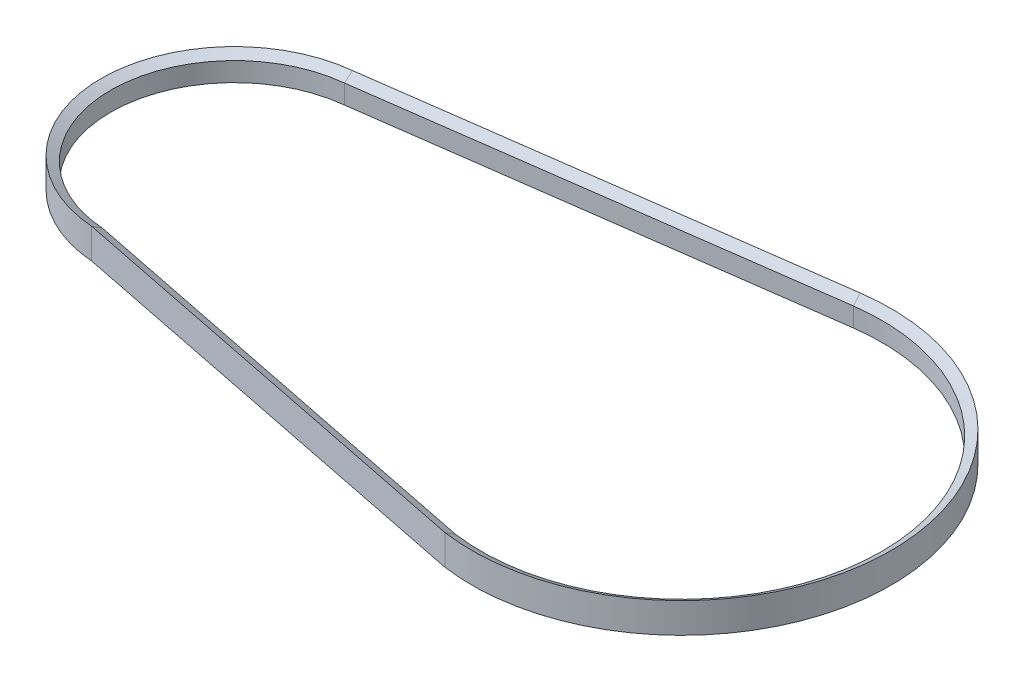
ISO-10303-21;
HEADER;
FILE_DESCRIPTION(('STEP AP214'),'2;1');
FILE_NAME('part.step','',(''),(''),'','','');
FILE_SCHEMA(('AUTOMOTIVE_DESIGN { 1 0 10303 214 1 1 1 1 }'));
ENDSEC;
DATA;
#1=APPLICATION_CONTEXT('core data for automotive mechanical design processes');
#2=APPLICATION_PROTOCOL_DEFINITION('international standard','automotive_design',2000,#1);
#3=PRODUCT_CONTEXT('',#1,'mechanical');
#4=PRODUCT('Part','Part','',(#3));
#5=PRODUCT_RELATED_PRODUCT_CATEGORY('part','',(#4));
#6=PRODUCT_DEFINITION_FORMATION('','',#4);
#7=PRODUCT_DEFINITION_CONTEXT('part definition',#1,'design');
#8=PRODUCT_DEFINITION('design','',#6,#7);
#9=PRODUCT_DEFINITION_SHAPE('','',#8);
#10=(LENGTH_UNIT() NAMED_UNIT(*) SI_UNIT(.MILLI.,.METRE.));
#11=(NAMED_UNIT(*) PLANE_ANGLE_UNIT() SI_UNIT($,.RADIAN.));
#12=(NAMED_UNIT(*) SI_UNIT($,.STERADIAN.) SOLID_ANGLE_UNIT());
#13=UNCERTAINTY_MEASURE_WITH_UNIT(LENGTH_MEASURE(1.E-05),#10,'distance_accuracy_value','');
#14=(GEOMETRIC_REPRESENTATION_CONTEXT(3) GLOBAL_UNCERTAINTY_ASSIGNED_CONTEXT((#13)) GLOBAL_UNIT_ASSIGNED_CONTEXT((#10,
#11,#12)) REPRESENTATION_CONTEXT('',''));
#15=CARTESIAN_POINT('',(0.,0.,0.));
#16=DIRECTION('',(0.,0.,1.));
#17=DIRECTION('',(1.,0.,0.));
#18=AXIS2_PLACEMENT_3D('',#15,#16,#17);
#19=CARTESIAN_POINT('',(-175.632341165328,6.035,-67.3771283987051));
#20=CARTESIAN_POINT('',(-185.237254141952,6.035,-66.4378723842523));
#21=CARTESIAN_POINT('',(-194.658380370483,6.035,-63.703087416971));
#22=CARTESIAN_POINT('',(-211.884484564325,6.035,-55.0078043698601));
#23=CARTESIAN_POINT('',(-219.681545041226,6.035,-49.0502554772838));
#24=CARTESIAN_POINT('',(-232.597850928129,6.035,-34.7144382072296));
#25=CARTESIAN_POINT('',(-237.713089284471,6.035,-26.3406172727995));
#26=CARTESIAN_POINT('',(-244.571622033232,6.035,-8.30434428981852));
#27=CARTESIAN_POINT('',(-246.312788677549,6.035,1.3525123001358));
#28=CARTESIAN_POINT('',(-246.18537714653,6.035,20.6483766465883));
#29=CARTESIAN_POINT('',(-244.316838498208,6.035,30.2813981771387));
#30=CARTESIAN_POINT('',(-237.220725399809,6.035,48.2255279541108));
#31=CARTESIAN_POINT('',(-231.995352402364,6.035,56.5310693291795));
#32=CARTESIAN_POINT('',(-218.890860831098,6.035,70.6950700071189));
#33=CARTESIAN_POINT('',(-211.015807692234,6.035,76.549135171205));
#34=CARTESIAN_POINT('',(-198.011236780126,6.035,82.8994190390512));
#35=CARTESIAN_POINT('',(-193.480610063308,6.035,84.6138788124924));
#36=CARTESIAN_POINT('',(-186.505233760073,6.035,86.5388882090312));
#37=CARTESIAN_POINT('',(-184.150385545113,6.035,87.0729563367836));
#38=CARTESIAN_POINT('',(-180.588649150114,6.035,87.7092187694637));
#39=CARTESIAN_POINT('',(-179.396494345239,6.035,87.8938484068089));
#40=CARTESIAN_POINT('',(-177.602772085792,6.035,88.129312317237));
#41=CARTESIAN_POINT('',(-177.0039493934,6.035,88.2008877864313));
#42=CARTESIAN_POINT('',(-176.104573473844,6.035,88.2978534914191));
#43=CARTESIAN_POINT('',(-175.804591160262,6.035,88.3284425301635));
#44=CARTESIAN_POINT('',(-175.204284000891,6.035,88.3861507144398));
#45=CARTESIAN_POINT('',(-174.915497802583,6.035,88.4140258141559));
#46=CARTESIAN_POINT('',(-174.147647121336,6.035,88.474629690754));
#47=CARTESIAN_POINT('',(-173.645566079561,6.035,88.5093176272365));
#48=CARTESIAN_POINT('',(-173.185405065056,6.035,88.543263703195));
#49=CARTESIAN_POINT('',(-177.100774969533,9.49910161513779,-73.1946624263381));
#50=CARTESIAN_POINT('',(-187.42333734258,9.49910161513779,-72.0742608219077));
#51=CARTESIAN_POINT('',(-197.527627740796,9.49910161513779,-69.0242677730329));
#52=CARTESIAN_POINT('',(-215.960583842075,9.49910161513779,-59.4724382332807));
#53=CARTESIAN_POINT('',(-224.280765375311,9.49910161513779,-52.9738651898177));
#54=CARTESIAN_POINT('',(-238.012536541069,9.49910161513779,-37.4030662160828));
#55=CARTESIAN_POINT('',(-243.419866136595,9.49910161513779,-28.3356708608856));
#56=CARTESIAN_POINT('',(-250.592119914945,9.49910161513779,-8.85311210213119));
#57=CARTESIAN_POINT('',(-252.354819023709,9.49910161513779,1.55600715602898));
#58=CARTESIAN_POINT('',(-251.996928136017,9.49910161513779,22.313734251216));
#59=CARTESIAN_POINT('',(-249.876449170169,9.49910161513779,32.6559023429134));
#60=CARTESIAN_POINT('',(-242.036847299154,9.49910161513779,51.8796366975172));
#61=CARTESIAN_POINT('',(-236.32015650249,9.49910161513779,60.7552391119491));
#62=CARTESIAN_POINT('',(-222.059783717249,9.49910161513779,75.843416207539));
#63=CARTESIAN_POINT('',(-213.520525756567,9.49910161513779,82.0513100388617));
#64=CARTESIAN_POINT('',(-199.457069405949,9.49910161513779,88.7343529059627));
#65=CARTESIAN_POINT('',(-194.563238321873,9.49910161513779,90.5269830762957));
#66=CARTESIAN_POINT('',(-187.036848190213,9.49910161513779,92.5181530127195));
#67=CARTESIAN_POINT('',(-184.497306009134,9.49910161513779,93.0657744355057));
#68=CARTESIAN_POINT('',(-180.658180612421,9.49910161513779,93.7095288463449));
#69=CARTESIAN_POINT('',(-179.373504722959,9.49910161513779,93.894517336249));
#70=CARTESIAN_POINT('',(-177.441059185925,9.49910161513779,94.1273109808718));
#71=CARTESIAN_POINT('',(-176.796005095335,9.49910161513779,94.1974616710112));
#72=CARTESIAN_POINT('',(-175.827314469135,9.49910161513779,94.2914886355029));
#73=CARTESIAN_POINT('',(-175.504232649132,9.49910161513779,94.3209645025104));
#74=CARTESIAN_POINT('',(-174.857740209242,9.49910161513779,94.3761792807161));
#75=CARTESIAN_POINT('',(-174.534329516169,9.49910161513779,94.4019172316852));
#76=CARTESIAN_POINT('',(-173.738082770915,9.49910161513779,94.4606587283713));
#77=CARTESIAN_POINT('',(-173.265390352702,9.49910161513779,94.495527834314));
#78=CARTESIAN_POINT('',(-172.792698049384,9.49910161513779,94.5303983433916));
#79=B_SPLINE_SURFACE_WITH_KNOTS('',1,3,((#19,#20,#21,#22,#23,#24,#25,#26,#27,#28,#29,#30,#31,
#32,#33,#34,#35,#36,#37,#38,#39,#40,#41,#42,#43,#44,#45,#46,#47,#48),(#49,#50,#51,#52,#53,#54,
#55,#56,#57,#58,#59,#60,#61,#62,#63,#64,#65,#66,#67,#68,#69,#70,#71,#72,#73,#74,#75,#76,#77,
#78)),.UNSPECIFIED.,.F.,.F.,.F.,(2,2),(4,2,2,2,2,2,2,2,2,2,2,2,2,2,4),(0.,1.),(0.,0.125,0.25,
0.375,0.5,0.625,0.75,0.875,0.9375,0.96875,0.984375,0.9921875,0.99609375,1.,1.00570677779079),.UNSPECIFIED.);
#80=CARTESIAN_POINT('',(-168.018381128625,9.49910161513779,10.4838833432834));
#81=DIRECTION('',(0.,1.,0.));
#82=DIRECTION('',(-0.107905356313509,0.,-0.994161171077836));
#83=AXIS2_PLACEMENT_3D('',#80,#81,#82);
#84=CIRCLE('',#83,84.17);
#85=CARTESIAN_POINT('',(-177.100774969533,9.49910161513779,-73.1946624263381));
#86=VERTEX_POINT('',#85);
#87=CARTESIAN_POINT('',(-174.210774969533,9.49910161513779,94.4257868153818));
#88=VERTEX_POINT('',#87);
#89=EDGE_CURVE('E122',#86,#88,#84,.T.);
#90=DIRECTION('',(0.116985175980847,-0.502920102456255,-0.85637949481881));
#91=VECTOR('',#90,1.);
#92=CARTESIAN_POINT('',(-173.402080475366,6.02251824077057,88.5058112580416));
#93=LINE('',#92,#91);
#94=CARTESIAN_POINT('',(-173.404992399068,6.03499357085896,88.5271331816048));
#95=VERTEX_POINT('',#94);
#96=EDGE_CURVE('E120',#88,#95,#93,.T.);
#97=CARTESIAN_POINT('',(-175.632341165328,6.035,-67.3771283987051));
#98=CARTESIAN_POINT('',(-185.237254141952,6.035,-66.4378723842523));
#99=CARTESIAN_POINT('',(-194.658380370483,6.035,-63.703087416971));
#100=CARTESIAN_POINT('',(-211.884484564325,6.035,-55.0078043698601));
#101=CARTESIAN_POINT('',(-219.681545041226,6.035,-49.0502554772838));
#102=CARTESIAN_POINT('',(-232.597850928129,6.035,-34.7144382072296));
#103=CARTESIAN_POINT('',(-237.713089284471,6.035,-26.3406172727995));
#104=CARTESIAN_POINT('',(-244.571622033232,6.035,-8.30434428981852));
#105=CARTESIAN_POINT('',(-246.312788677549,6.035,1.3525123001358));
#106=CARTESIAN_POINT('',(-246.18537714653,6.035,20.6483766465883));
#107=CARTESIAN_POINT('',(-244.316838498208,6.035,30.2813981771387));
#108=CARTESIAN_POINT('',(-237.220725399809,6.035,48.2255279541108));
#109=CARTESIAN_POINT('',(-231.995352402364,6.035,56.5310693291795));
#110=CARTESIAN_POINT('',(-218.890860831098,6.035,70.6950700071189));
#111=CARTESIAN_POINT('',(-211.015807692234,6.035,76.549135171205));
#112=CARTESIAN_POINT('',(-198.011236780126,6.035,82.8994190390512));
#113=CARTESIAN_POINT('',(-193.480610063308,6.035,84.6138788124924));
#114=CARTESIAN_POINT('',(-186.505233760073,6.035,86.5388882090312));
#115=CARTESIAN_POINT('',(-184.150385545113,6.035,87.0729563367836));
#116=CARTESIAN_POINT('',(-180.588649150114,6.035,87.7092187694637));
#117=CARTESIAN_POINT('',(-179.396494345239,6.035,87.8938484068089));
#118=CARTESIAN_POINT('',(-177.602772085792,6.035,88.129312317237));
#119=CARTESIAN_POINT('',(-177.0039493934,6.035,88.2008877864313));
#120=CARTESIAN_POINT('',(-176.104573473844,6.035,88.2978534914191));
#121=CARTESIAN_POINT('',(-175.804591160262,6.035,88.3284425301635));
#122=CARTESIAN_POINT('',(-175.204284000891,6.035,88.3861507144398));
#123=CARTESIAN_POINT('',(-174.915497802583,6.035,88.4140258141559));
#124=CARTESIAN_POINT('',(-174.147647121336,6.035,88.474629690754));
#125=CARTESIAN_POINT('',(-173.645566079561,6.035,88.5093176272365));
#126=CARTESIAN_POINT('',(-173.185405065056,6.035,88.543263703195));
#127=B_SPLINE_CURVE_WITH_KNOTS('',3,(#97,#98,#99,#100,#101,#102,#103,#104,#105,#106,#107,#108,
#109,#110,#111,#112,#113,#114,#115,#116,#117,#118,#119,#120,#121,#122,#123,#124,#125,#126),
.UNSPECIFIED.,.F.,.F.,(4,2,2,2,2,2,2,2,2,2,2,2,2,2,4),(0.,0.125,0.25,0.375,0.5,0.625,0.75,0.875,
0.9375,0.96875,0.984375,0.9921875,0.99609375,1.,1.00570677779079),.UNSPECIFIED.);
#128=CARTESIAN_POINT('',(-176.233522657911,6.03500000102744,-67.3159703417956));
#129=VERTEX_POINT('',#128);
#130=EDGE_CURVE('E105',#129,#95,#127,.T.);
#131=CARTESIAN_POINT('',(-177.100774969533,9.4991016151378,-73.1946624263381));
#132=CARTESIAN_POINT('',(-177.070185434788,9.35289209617074,-72.9457145201803));
#133=CARTESIAN_POINT('',(-177.038837245244,9.20667812534822,-72.6968630481487));
#134=CARTESIAN_POINT('',(-176.974612198366,8.91424516720016,-72.1993612618063));
#135=CARTESIAN_POINT('',(-176.941735344881,8.76802617988819,-71.950710946991));
#136=CARTESIAN_POINT('',(-176.840794648049,8.32936699964838,-71.2050732788226));
#137=CARTESIAN_POINT('',(-176.770420547175,8.0369240088802,-70.7083982149693));
#138=CARTESIAN_POINT('',(-176.625423906501,7.4595352879286,-69.7286120273284));
#139=CARTESIAN_POINT('',(-176.550955757575,7.1745888180845,-69.2454784293488));
#140=CARTESIAN_POINT('',(-176.396402263557,6.60474786387748,-68.2800723247583));
#141=CARTESIAN_POINT('',(-176.316316858248,6.3198533801047,-67.7977998274352));
#142=CARTESIAN_POINT('',(-176.233522547226,6.03500000824067,-67.3159703681356));
#143=B_SPLINE_CURVE_WITH_KNOTS('',3,(#131,#132,#133,#134,#135,#136,#137,#138,#139,#140,#141,
#142),.UNSPECIFIED.,.F.,.F.,(4,2,2,2,2,4),(0.,0.870969813143623,1.74193743439122,
3.48386922475516,5.18131622870672,6.87878143228413),.UNSPECIFIED.);
#144=EDGE_CURVE('E117',#86,#129,#143,.T.);
#145=ORIENTED_EDGE('',*,*,#89,.T.);
#146=ORIENTED_EDGE('',*,*,#96,.T.);
#147=ORIENTED_EDGE('',*,*,#130,.F.);
#148=ORIENTED_EDGE('',*,*,#144,.F.);
#149=EDGE_LOOP('',(#145,#146,#147,#148));
#150=FACE_BOUND('',#149,.T.);
#151=ADVANCED_FACE('F33',(#150),#79,.T.);
#152=CARTESIAN_POINT('',(-177.100774969533,-9.49910161513781,-73.1946624263381));
#153=CARTESIAN_POINT('',(-187.42333734258,-9.49910161513781,-72.0742608219077));
#154=CARTESIAN_POINT('',(-197.527627740796,-9.49910161513781,-69.0242677730329));
#155=CARTESIAN_POINT('',(-215.960583842075,-9.49910161513781,-59.4724382332807));
#156=CARTESIAN_POINT('',(-224.280765375311,-9.49910161513781,-52.9738651898177));
#157=CARTESIAN_POINT('',(-238.012536541069,-9.49910161513781,-37.4030662160828));
#158=CARTESIAN_POINT('',(-243.419866136595,-9.49910161513781,-28.3356708608856));
#159=CARTESIAN_POINT('',(-250.592119914945,-9.49910161513781,-8.85311210213119));
#160=CARTESIAN_POINT('',(-252.354819023709,-9.49910161513781,1.55600715602898));
#161=CARTESIAN_POINT('',(-251.996928136017,-9.49910161513781,22.313734251216));
#162=CARTESIAN_POINT('',(-249.876449170169,-9.49910161513781,32.6559023429134));
#163=CARTESIAN_POINT('',(-242.036847299154,-9.49910161513781,51.8796366975172));
#164=CARTESIAN_POINT('',(-236.32015650249,-9.49910161513781,60.7552391119491));
#165=CARTESIAN_POINT('',(-222.059783717249,-9.49910161513781,75.843416207539));
#166=CARTESIAN_POINT('',(-213.520525756567,-9.49910161513781,82.0513100388617));
#167=CARTESIAN_POINT('',(-199.457069405949,-9.49910161513781,88.7343529059627));
#168=CARTESIAN_POINT('',(-194.563238321873,-9.49910161513781,90.5269830762957));
#169=CARTESIAN_POINT('',(-187.036848190213,-9.49910161513781,92.5181530127195));
#170=CARTESIAN_POINT('',(-184.497306009134,-9.49910161513781,93.0657744355057));
#171=CARTESIAN_POINT('',(-180.658180612421,-9.49910161513781,93.7095288463449));
#172=CARTESIAN_POINT('',(-179.373504722959,-9.49910161513781,93.894517336249));
#173=CARTESIAN_POINT('',(-177.441059185925,-9.49910161513781,94.1273109808718));
#174=CARTESIAN_POINT('',(-176.796005095335,-9.49910161513781,94.1974616710112));
#175=CARTESIAN_POINT('',(-175.827314469135,-9.49910161513781,94.2914886355029));
#176=CARTESIAN_POINT('',(-175.504232649132,-9.49910161513781,94.3209645025104));
#177=CARTESIAN_POINT('',(-174.857740209242,-9.49910161513781,94.3761792807161));
#178=CARTESIAN_POINT('',(-174.534329516169,-9.49910161513781,94.4019172316852));
#179=CARTESIAN_POINT('',(-173.738082770915,-9.49910161513781,94.4606587283713));
#180=CARTESIAN_POINT('',(-173.265390352702,-9.49910161513781,94.495527834314));
#181=CARTESIAN_POINT('',(-172.792698049384,-9.49910161513781,94.5303983433916));
#182=CARTESIAN_POINT('',(-175.632341165328,-6.035,-67.3771283987051));
#183=CARTESIAN_POINT('',(-185.23725414206,-6.035,-66.4378723842417));
#184=CARTESIAN_POINT('',(-194.658380370339,-6.035,-63.7030874169709));
#185=CARTESIAN_POINT('',(-211.884484564469,-6.035,-55.0078043698601));
#186=CARTESIAN_POINT('',(-219.68154504137,-6.035,-49.0502554772838));
#187=CARTESIAN_POINT('',(-232.597850927985,-6.035,-34.7144382072296));
#188=CARTESIAN_POINT('',(-237.713089284615,-6.035,-26.3406172727995));
#189=CARTESIAN_POINT('',(-244.571622033087,-6.035,-8.30434428981851));
#190=CARTESIAN_POINT('',(-246.312788677549,-6.035,1.3525123001358));
#191=CARTESIAN_POINT('',(-246.18537714653,-6.035,20.6483766465883));
#192=CARTESIAN_POINT('',(-244.316838498208,-6.035,30.2813981771386));
#193=CARTESIAN_POINT('',(-237.220725399809,-6.035,48.2255279541108));
#194=CARTESIAN_POINT('',(-231.995352402508,-6.035,56.5310693288913));
#195=CARTESIAN_POINT('',(-218.890860830954,-6.035,70.695070007407));
#196=CARTESIAN_POINT('',(-211.01580769209,-6.035,76.549135171349));
#197=CARTESIAN_POINT('',(-198.011236780199,-6.035,82.8994190389791));
#198=CARTESIAN_POINT('',(-193.480610063308,-6.035,84.6138788124923));
#199=CARTESIAN_POINT('',(-186.505233760073,-6.035,86.5388882090312));
#200=CARTESIAN_POINT('',(-184.150385545113,-6.035,87.0729563367836));
#201=CARTESIAN_POINT('',(-180.588649150114,-6.035,87.7092187694636));
#202=CARTESIAN_POINT('',(-179.396494345239,-6.035,87.8938484068089));
#203=CARTESIAN_POINT('',(-177.602772085792,-6.035,88.1293123172369));
#204=CARTESIAN_POINT('',(-177.0039493934,-6.035,88.2008877864312));
#205=CARTESIAN_POINT('',(-176.104573473844,-6.035,88.297853491419));
#206=CARTESIAN_POINT('',(-175.804591160258,-6.035,88.3284425301634));
#207=CARTESIAN_POINT('',(-175.204284000896,-6.035,88.3861507144398));
#208=CARTESIAN_POINT('',(-174.915497802583,-6.035,88.4140258141558));
#209=CARTESIAN_POINT('',(-174.147647121336,-6.035,88.4746296907539));
#210=CARTESIAN_POINT('',(-173.645566079561,-6.035,88.5093176272364));
#211=CARTESIAN_POINT('',(-173.185405065056,-6.035,88.5432637031949));
#212=B_SPLINE_SURFACE_WITH_KNOTS('',1,3,((#152,#153,#154,#155,#156,#157,#158,#159,#160,#161,
#162,#163,#164,#165,#166,#167,#168,#169,#170,#171,#172,#173,#174,#175,#176,#177,#178,#179,#180,
#181),(#182,#183,#184,#185,#186,#187,#188,#189,#190,#191,#192,#193,#194,#195,#196,#197,#198,
#199,#200,#201,#202,#203,#204,#205,#206,#207,#208,#209,#210,#211)),.UNSPECIFIED.,.F.,.F.,.F.,(2,
2),(4,2,2,2,2,2,2,2,2,2,2,2,2,2,4),(0.,1.),(0.,0.125,0.25,0.375,0.5,0.625,0.75,0.875,0.9375,
0.96875,0.984375,0.9921875,0.99609375,1.,1.00570677779079),.UNSPECIFIED.);
#213=CARTESIAN_POINT('',(-175.632341165328,-6.035,-67.3771283987051));
#214=CARTESIAN_POINT('',(-185.23725414206,-6.035,-66.4378723842417));
#215=CARTESIAN_POINT('',(-194.658380370339,-6.035,-63.7030874169709));
#216=CARTESIAN_POINT('',(-211.884484564469,-6.035,-55.0078043698601));
#217=CARTESIAN_POINT('',(-219.68154504137,-6.035,-49.0502554772838));
#218=CARTESIAN_POINT('',(-232.597850927985,-6.035,-34.7144382072296));
#219=CARTESIAN_POINT('',(-237.713089284615,-6.035,-26.3406172727995));
#220=CARTESIAN_POINT('',(-244.571622033087,-6.035,-8.30434428981851));
#221=CARTESIAN_POINT('',(-246.312788677549,-6.035,1.3525123001358));
#222=CARTESIAN_POINT('',(-246.18537714653,-6.035,20.6483766465883));
#223=CARTESIAN_POINT('',(-244.316838498208,-6.035,30.2813981771386));
#224=CARTESIAN_POINT('',(-237.220725399809,-6.035,48.2255279541108));
#225=CARTESIAN_POINT('',(-231.995352402508,-6.035,56.5310693288913));
#226=CARTESIAN_POINT('',(-218.890860830954,-6.035,70.695070007407));
#227=CARTESIAN_POINT('',(-211.01580769209,-6.035,76.549135171349));
#228=CARTESIAN_POINT('',(-198.011236780199,-6.035,82.8994190389791));
#229=CARTESIAN_POINT('',(-193.480610063308,-6.035,84.6138788124923));
#230=CARTESIAN_POINT('',(-186.505233760073,-6.035,86.5388882090312));
#231=CARTESIAN_POINT('',(-184.150385545113,-6.035,87.0729563367836));
#232=CARTESIAN_POINT('',(-180.588649150114,-6.035,87.7092187694636));
#233=CARTESIAN_POINT('',(-179.396494345239,-6.035,87.8938484068089));
#234=CARTESIAN_POINT('',(-177.602772085792,-6.035,88.1293123172369));
#235=CARTESIAN_POINT('',(-177.0039493934,-6.035,88.2008877864312));
#236=CARTESIAN_POINT('',(-176.104573473844,-6.035,88.297853491419));
#237=CARTESIAN_POINT('',(-175.804591160258,-6.035,88.3284425301634));
#238=CARTESIAN_POINT('',(-175.204284000896,-6.035,88.3861507144398));
#239=CARTESIAN_POINT('',(-174.915497802583,-6.035,88.4140258141558));
#240=CARTESIAN_POINT('',(-174.147647121336,-6.035,88.4746296907539));
#241=CARTESIAN_POINT('',(-173.645566079561,-6.035,88.5093176272364));
#242=CARTESIAN_POINT('',(-173.185405065056,-6.035,88.5432637031949));
#243=B_SPLINE_CURVE_WITH_KNOTS('',3,(#213,#214,#215,#216,#217,#218,#219,#220,#221,#222,#223,
#224,#225,#226,#227,#228,#229,#230,#231,#232,#233,#234,#235,#236,#237,#238,#239,#240,#241,#242),
.UNSPECIFIED.,.F.,.F.,(4,2,2,2,2,2,2,2,2,2,2,2,2,2,4),(0.,0.125,0.25,0.375,0.5,0.625,0.75,0.875,
0.9375,0.96875,0.984375,0.9921875,0.99609375,1.,1.00570677779079),.UNSPECIFIED.);
#244=CARTESIAN_POINT('',(-176.233522544831,-6.035,-67.3159703541965));
#245=VERTEX_POINT('',#244);
#246=CARTESIAN_POINT('',(-173.404992399068,-6.03499357085895,88.5271331816048));
#247=VERTEX_POINT('',#246);
#248=EDGE_CURVE('E107',#245,#247,#243,.T.);
#249=DIRECTION('',(-0.116985175980847,-0.502920102456255,0.85637949481881));
#250=VECTOR('',#249,1.);
#251=CARTESIAN_POINT('',(-174.210774969533,-9.49910161513781,94.4257868153819));
#252=LINE('',#251,#250);
#253=CARTESIAN_POINT('',(-174.210774969533,-9.49910161513781,94.4257868153818));
#254=VERTEX_POINT('',#253);
#255=EDGE_CURVE('E229',#247,#254,#252,.T.);
#256=CARTESIAN_POINT('',(-168.018381128625,-9.49910161513781,10.4838833432834));
#257=DIRECTION('',(0.,1.,0.));
#258=DIRECTION('',(-0.107905356313509,0.,-0.994161171077836));
#259=AXIS2_PLACEMENT_3D('',#256,#257,#258);
#260=CIRCLE('',#259,84.17);
#261=CARTESIAN_POINT('',(-177.100774969533,-9.49910161513781,-73.1946624263381));
#262=VERTEX_POINT('',#261);
#263=EDGE_CURVE('E40',#262,#254,#260,.T.);
#264=CARTESIAN_POINT('',(-176.23352299715,-6.03500000308232,-67.315970304593));
#265=CARTESIAN_POINT('',(-176.275995229731,-6.18115792998691,-67.5631977180714));
#266=CARTESIAN_POINT('',(-176.317762310838,-6.32732614451675,-67.8105397436875));
#267=CARTESIAN_POINT('',(-176.39984920483,-6.61968036734504,-68.305453274821));
#268=CARTESIAN_POINT('',(-176.440169017792,-6.76586637564253,-68.5530247803259));
#269=CARTESIAN_POINT('',(-176.55890195418,-7.20444635479077,-69.29608294422));
#270=CARTESIAN_POINT('',(-176.635088746202,-7.49686286768814,-69.7919142442019));
#271=CARTESIAN_POINT('',(-176.779463851065,-8.07425362699639,-70.7717892802347));
#272=CARTESIAN_POINT('',(-176.847806745141,-8.35922721520768,-71.2558106569929));
#273=CARTESIAN_POINT('',(-176.978664316197,-8.92917372057446,-72.2246522996759));
#274=CARTESIAN_POINT('',(-177.041178893494,-9.21414663763515,-72.7094725791204));
#275=CARTESIAN_POINT('',(-177.100774969533,-9.4991016151378,-73.1946624263381));
#276=B_SPLINE_CURVE_WITH_KNOTS('',3,(#264,#265,#266,#267,#268,#269,#270,#271,#272,#273,#274,
#275),.UNSPECIFIED.,.F.,.F.,(4,2,2,2,2,4),(0.,0.870967149194419,1.7419342512395,
3.48386495276856,5.18130840599312,6.87878088554142),.UNSPECIFIED.);
#277=EDGE_CURVE('E97',#245,#262,#276,.T.);
#278=ORIENTED_EDGE('',*,*,#248,.T.);
#279=ORIENTED_EDGE('',*,*,#255,.T.);
#280=ORIENTED_EDGE('',*,*,#263,.F.);
#281=ORIENTED_EDGE('',*,*,#277,.F.);
#282=EDGE_LOOP('',(#278,#279,#280,#281));
#283=FACE_BOUND('',#282,.T.);
#284=ADVANCED_FACE('F267',(#283),#212,.T.);
#285=CARTESIAN_POINT('',(-175.632341165328,-6.035,-67.3771283987051));
#286=CARTESIAN_POINT('',(-185.23725414206,-6.035,-66.4378723842417));
#287=CARTESIAN_POINT('',(-194.658380370339,-6.035,-63.7030874169709));
#288=CARTESIAN_POINT('',(-211.884484564469,-6.035,-55.0078043698601));
#289=CARTESIAN_POINT('',(-219.68154504137,-6.035,-49.0502554772838));
#290=CARTESIAN_POINT('',(-232.597850927985,-6.035,-34.7144382072296));
#291=CARTESIAN_POINT('',(-237.713089284615,-6.035,-26.3406172727995));
#292=CARTESIAN_POINT('',(-244.571622033087,-6.035,-8.30434428981851));
#293=CARTESIAN_POINT('',(-246.312788677549,-6.035,1.3525123001358));
#294=CARTESIAN_POINT('',(-246.18537714653,-6.035,20.6483766465883));
#295=CARTESIAN_POINT('',(-244.316838498208,-6.035,30.2813981771386));
#296=CARTESIAN_POINT('',(-237.220725399809,-6.035,48.2255279541108));
#297=CARTESIAN_POINT('',(-231.995352402508,-6.035,56.5310693288913));
#298=CARTESIAN_POINT('',(-218.890860830954,-6.035,70.695070007407));
#299=CARTESIAN_POINT('',(-211.01580769209,-6.035,76.549135171349));
#300=CARTESIAN_POINT('',(-198.011236780199,-6.035,82.8994190389791));
#301=CARTESIAN_POINT('',(-193.480610063308,-6.035,84.6138788124923));
#302=CARTESIAN_POINT('',(-186.505233760073,-6.035,86.5388882090312));
#303=CARTESIAN_POINT('',(-184.150385545113,-6.035,87.0729563367836));
#304=CARTESIAN_POINT('',(-180.588649150114,-6.035,87.7092187694636));
#305=CARTESIAN_POINT('',(-179.396494345239,-6.035,87.8938484068089));
#306=CARTESIAN_POINT('',(-177.602772085792,-6.035,88.1293123172369));
#307=CARTESIAN_POINT('',(-177.0039493934,-6.035,88.2008877864312));
#308=CARTESIAN_POINT('',(-176.104573473844,-6.035,88.297853491419));
#309=CARTESIAN_POINT('',(-175.804591160258,-6.035,88.3284425301634));
#310=CARTESIAN_POINT('',(-175.204284000896,-6.035,88.3861507144398));
#311=CARTESIAN_POINT('',(-174.915497802583,-6.035,88.4140258141558));
#312=CARTESIAN_POINT('',(-174.147647121336,-6.035,88.4746296907539));
#313=CARTESIAN_POINT('',(-173.645566079561,-6.035,88.5093176272364));
#314=CARTESIAN_POINT('',(-173.185405065056,-6.035,88.5432637031949));
#315=CARTESIAN_POINT('',(-175.632341165328,6.035,-67.3771283987051));
#316=CARTESIAN_POINT('',(-185.237254141952,6.035,-66.4378723842523));
#317=CARTESIAN_POINT('',(-194.658380370483,6.035,-63.703087416971));
#318=CARTESIAN_POINT('',(-211.884484564325,6.035,-55.0078043698601));
#319=CARTESIAN_POINT('',(-219.681545041226,6.035,-49.0502554772838));
#320=CARTESIAN_POINT('',(-232.597850928129,6.035,-34.7144382072296));
#321=CARTESIAN_POINT('',(-237.713089284471,6.035,-26.3406172727995));
#322=CARTESIAN_POINT('',(-244.571622033232,6.035,-8.30434428981852));
#323=CARTESIAN_POINT('',(-246.312788677549,6.035,1.3525123001358));
#324=CARTESIAN_POINT('',(-246.18537714653,6.035,20.6483766465883));
#325=CARTESIAN_POINT('',(-244.316838498208,6.035,30.2813981771387));
#326=CARTESIAN_POINT('',(-237.220725399809,6.035,48.2255279541108));
#327=CARTESIAN_POINT('',(-231.995352402364,6.035,56.5310693291795));
#328=CARTESIAN_POINT('',(-218.890860831098,6.035,70.6950700071189));
#329=CARTESIAN_POINT('',(-211.015807692234,6.035,76.549135171205));
#330=CARTESIAN_POINT('',(-198.011236780126,6.035,82.8994190390512));
#331=CARTESIAN_POINT('',(-193.480610063308,6.035,84.6138788124924));
#332=CARTESIAN_POINT('',(-186.505233760073,6.035,86.5388882090312));
#333=CARTESIAN_POINT('',(-184.150385545113,6.035,87.0729563367836));
#334=CARTESIAN_POINT('',(-180.588649150114,6.035,87.7092187694637));
#335=CARTESIAN_POINT('',(-179.396494345239,6.035,87.8938484068089));
#336=CARTESIAN_POINT('',(-177.602772085792,6.035,88.129312317237));
#337=CARTESIAN_POINT('',(-177.0039493934,6.035,88.2008877864313));
#338=CARTESIAN_POINT('',(-176.104573473844,6.035,88.2978534914191));
#339=CARTESIAN_POINT('',(-175.804591160262,6.035,88.3284425301635));
#340=CARTESIAN_POINT('',(-175.204284000891,6.035,88.3861507144398));
#341=CARTESIAN_POINT('',(-174.915497802583,6.035,88.4140258141559));
#342=CARTESIAN_POINT('',(-174.147647121336,6.035,88.474629690754));
#343=CARTESIAN_POINT('',(-173.645566079561,6.035,88.5093176272365));
#344=CARTESIAN_POINT('',(-173.185405065056,6.035,88.543263703195));
#345=B_SPLINE_SURFACE_WITH_KNOTS('',1,3,((#285,#286,#287,#288,#289,#290,#291,#292,#293,#294,
#295,#296,#297,#298,#299,#300,#301,#302,#303,#304,#305,#306,#307,#308,#309,#310,#311,#312,#313,
#314),(#315,#316,#317,#318,#319,#320,#321,#322,#323,#324,#325,#326,#327,#328,#329,#330,#331,
#332,#333,#334,#335,#336,#337,#338,#339,#340,#341,#342,#343,#344)),.UNSPECIFIED.,.F.,.F.,.F.,(2,
2),(4,2,2,2,2,2,2,2,2,2,2,2,2,2,4),(0.,1.),(0.,0.125,0.25,0.375,0.5,0.625,0.75,0.875,0.9375,
0.96875,0.984375,0.9921875,0.99609375,1.,1.00570677779079),.UNSPECIFIED.);
#346=DIRECTION('',(0.,-1.,0.));
#347=VECTOR('',#346,1.);
#348=CARTESIAN_POINT('',(-173.404983880485,6.035,88.5270653749702));
#349=LINE('',#348,#347);
#350=EDGE_CURVE('E132',#95,#247,#349,.T.);
#351=DIRECTION('',(0.,1.,0.));
#352=VECTOR('',#351,1.);
#353=CARTESIAN_POINT('',(-176.23352254483,0.,-67.3159703541966));
#354=LINE('',#353,#352);
#355=EDGE_CURVE('E103',#129,#245,#354,.F.);
#356=ORIENTED_EDGE('',*,*,#130,.T.);
#357=ORIENTED_EDGE('',*,*,#350,.T.);
#358=ORIENTED_EDGE('',*,*,#248,.F.);
#359=ORIENTED_EDGE('',*,*,#355,.F.);
#360=EDGE_LOOP('',(#356,#357,#358,#359));
#361=FACE_BOUND('',#360,.T.);
#362=ADVANCED_FACE('F35',(#361),#345,.T.);
#363=CARTESIAN_POINT('',(-168.018381128625,0.,10.4838833432834));
#364=DIRECTION('',(0.,1.,0.));
#365=DIRECTION('',(0.,0.,1.));
#366=AXIS2_PLACEMENT_3D('',#363,#364,#365);
#367=CYLINDRICAL_SURFACE('',#366,84.17);
#368=ORIENTED_EDGE('',*,*,#263,.T.);
#369=DIRECTION('',(0.,-1.,0.));
#370=VECTOR('',#369,1.);
#371=CARTESIAN_POINT('',(-174.210774969533,9.49910161513779,94.4257868153819));
#372=LINE('',#371,#370);
#373=EDGE_CURVE('E468',#88,#254,#372,.T.);
#374=ORIENTED_EDGE('',*,*,#373,.F.);
#375=ORIENTED_EDGE('',*,*,#89,.F.);
#376=DIRECTION('',(0.,1.,0.));
#377=VECTOR('',#376,1.);
#378=CARTESIAN_POINT('',(-177.100774969533,0.,-73.1946624263381));
#379=LINE('',#378,#377);
#380=EDGE_CURVE('E133',#86,#262,#379,.F.);
#381=ORIENTED_EDGE('',*,*,#380,.T.);
#382=EDGE_LOOP('',(#368,#374,#375,#381));
#383=FACE_BOUND('',#382,.T.);
#384=ADVANCED_FACE('F272',(#383),#367,.T.);
#385=CARTESIAN_POINT('',(104.909225030467,9.49910161513779,-111.906739862254));
#386=DIRECTION('',(-0.135996649150661,0.,-0.990709297129987));
#387=DIRECTION('',(-0.990709297129987,0.,0.135996649150661));
#388=AXIS2_PLACEMENT_3D('',#385,#386,#387);
#389=PLANE('',#388);
#390=ORIENTED_EDGE('',*,*,#380,.F.);
#391=DIRECTION('',(-0.990709297129987,0.,0.135996649150661));
#392=VECTOR('',#391,1.);
#393=CARTESIAN_POINT('',(104.909225030467,9.49910161513779,-111.906739862254));
#394=LINE('',#393,#392);
#395=CARTESIAN_POINT('',(104.909225030467,9.49910161513779,-111.906739862254));
#396=VERTEX_POINT('',#395);
#397=EDGE_CURVE('E131',#396,#86,#394,.T.);
#398=ORIENTED_EDGE('',*,*,#397,.F.);
#399=DIRECTION('',(0.,-1.,0.));
#400=VECTOR('',#399,1.);
#401=CARTESIAN_POINT('',(104.909225030467,9.49910161513779,-111.906739862254));
#402=LINE('',#401,#400);
#403=CARTESIAN_POINT('',(104.909225030467,-9.49910161513781,-111.906739862254));
#404=VERTEX_POINT('',#403);
#405=EDGE_CURVE('E160',#396,#404,#402,.T.);
#406=ORIENTED_EDGE('',*,*,#405,.T.);
#407=DIRECTION('',(-0.990709297129987,0.,0.135996649150661));
#408=VECTOR('',#407,1.);
#409=CARTESIAN_POINT('',(104.909225030467,-9.49910161513781,-111.906739862254));
#410=LINE('',#409,#408);
#411=EDGE_CURVE('E140',#404,#262,#410,.T.);
#412=ORIENTED_EDGE('',*,*,#411,.T.);
#413=EDGE_LOOP('',(#390,#398,#406,#412));
#414=FACE_BOUND('',#413,.T.);
#415=ADVANCED_FACE('F422',(#414),#389,.T.);
#416=CARTESIAN_POINT('',(106.541705448927,6.035,-106.133092169214));
#417=DIRECTION('',(0.135996649150661,0.,0.990709297129987));
#418=DIRECTION('',(0.990709297129987,0.,-0.135996649150661));
#419=AXIS2_PLACEMENT_3D('',#416,#417,#418);
#420=PLANE('',#419);
#421=DIRECTION('',(-0.990709297129987,0.,0.135996649150661));
#422=VECTOR('',#421,1.);
#423=CARTESIAN_POINT('',(106.541705448927,6.035,-106.133092169214));
#424=LINE('',#423,#422);
#425=CARTESIAN_POINT('',(106.549568561276,6.03508442513084,-106.135278235878));
#426=VERTEX_POINT('',#425);
#427=EDGE_CURVE('E128',#426,#129,#424,.T.);
#428=ORIENTED_EDGE('',*,*,#427,.T.);
#429=ORIENTED_EDGE('',*,*,#355,.T.);
#430=DIRECTION('',(-0.990709297129987,0.,0.135996649150661));
#431=VECTOR('',#430,1.);
#432=CARTESIAN_POINT('',(106.541705448927,-6.035,-106.133092169214));
#433=LINE('',#432,#431);
#434=CARTESIAN_POINT('',(106.549568561276,-6.03508442513085,-106.135278235878));
#435=VERTEX_POINT('',#434);
#436=EDGE_CURVE('E112',#435,#245,#433,.T.);
#437=ORIENTED_EDGE('',*,*,#436,.F.);
#438=DIRECTION('',(0.,1.,0.));
#439=VECTOR('',#438,1.);
#440=CARTESIAN_POINT('',(106.55737609582,6.035,-106.137545978723));
#441=LINE('',#440,#439);
#442=EDGE_CURVE('E137',#435,#426,#441,.T.);
#443=ORIENTED_EDGE('',*,*,#442,.T.);
#444=EDGE_LOOP('',(#428,#429,#437,#443));
#445=FACE_BOUND('',#444,.T.);
#446=ADVANCED_FACE('F135',(#445),#420,.T.);
#447=CARTESIAN_POINT('',(104.909225030467,-9.49910161513781,-111.906739862254));
#448=DIRECTION('',(0.0684941462973759,-0.863910221077573,0.498966613953973));
#449=DIRECTION('',(0.,-0.500141186388476,-0.865943874438712));
#450=AXIS2_PLACEMENT_3D('',#447,#448,#449);
#451=PLANE('',#450);
#452=ORIENTED_EDGE('',*,*,#436,.T.);
#453=ORIENTED_EDGE('',*,*,#277,.T.);
#454=ORIENTED_EDGE('',*,*,#411,.F.);
#455=DIRECTION('',(0.237890115311689,0.500000000000004,0.83271141041599));
#456=VECTOR('',#455,1.);
#457=CARTESIAN_POINT('',(104.909225030467,-9.49910161513781,-111.906739862254));
#458=LINE('',#457,#456);
#459=EDGE_CURVE('E154',#404,#435,#458,.T.);
#460=ORIENTED_EDGE('',*,*,#459,.T.);
#461=EDGE_LOOP('',(#452,#453,#454,#460));
#462=FACE_BOUND('',#461,.T.);
#463=ADVANCED_FACE('F382',(#462),#451,.T.);
#464=CARTESIAN_POINT('',(106.541705448927,6.035,-106.133092169214));
#465=DIRECTION('',(0.0684941462973759,0.863910221077573,0.498966613953972));
#466=DIRECTION('',(0.,-0.500141186388476,0.865943874438712));
#467=AXIS2_PLACEMENT_3D('',#464,#465,#466);
#468=PLANE('',#467);
#469=ORIENTED_EDGE('',*,*,#397,.T.);
#470=ORIENTED_EDGE('',*,*,#144,.T.);
#471=ORIENTED_EDGE('',*,*,#427,.F.);
#472=DIRECTION('',(-0.237890115311689,0.500000000000004,-0.83271141041599));
#473=VECTOR('',#472,1.);
#474=CARTESIAN_POINT('',(106.55737609582,6.035,-106.137545978723));
#475=LINE('',#474,#473);
#476=EDGE_CURVE('E357',#426,#396,#475,.T.);
#477=ORIENTED_EDGE('',*,*,#476,.T.);
#478=EDGE_LOOP('',(#469,#470,#471,#477));
#479=FACE_BOUND('',#478,.T.);
#480=ADVANCED_FACE('F127',(#479),#468,.T.);
#481=CARTESIAN_POINT('',(-173.858436596857,6.035,88.4361409434508));
#482=DIRECTION('',(0.0990179741558364,0.863910221077573,-0.493816332973883));
#483=DIRECTION('',(0.,0.496255106761762,0.868176749868869));
#484=AXIS2_PLACEMENT_3D('',#481,#482,#483);
#485=PLANE('',#484);
#486=CARTESIAN_POINT('',(105.948795273003,6.03499999999994,144.541910242441));
#487=CARTESIAN_POINT('',(105.844392755031,6.36897916762967,145.105257932949));
#488=CARTESIAN_POINT('',(105.741220679583,6.70295017636071,145.668838072978));
#489=CARTESIAN_POINT('',(105.537303448483,7.37087179954582,146.796449309884));
#490=CARTESIAN_POINT('',(105.436558292726,7.70482241400077,147.360480406742));
#491=CARTESIAN_POINT('',(105.191889642078,8.5255691449745,148.747281227107));
#492=CARTESIAN_POINT('',(105.049312321733,9.01235151150111,149.570296824857));
#493=CARTESIAN_POINT('',(104.909225030467,9.49910161513781,150.393755270242));
#494=B_SPLINE_CURVE_WITH_KNOTS('',3,(#486,#487,#488,#489,#490,#491,#492,#493),.UNSPECIFIED.,.F.,
.F.,(4,2,2,4),(0.,1.98952659893986,3.9790531117515,6.87934284405319),.UNSPECIFIED.);
#495=CARTESIAN_POINT('',(105.948795273002,6.035,144.541910242441));
#496=VERTEX_POINT('',#495);
#497=CARTESIAN_POINT('',(104.909225030466,9.49910161513779,150.393755270242));
#498=VERTEX_POINT('',#497);
#499=EDGE_CURVE('E11',#496,#498,#494,.T.);
#500=ORIENTED_EDGE('',*,*,#499,.F.);
#501=DIRECTION('',(0.98048329982453,0.,0.196602387486015));
#502=VECTOR('',#501,1.);
#503=CARTESIAN_POINT('',(-173.858436596857,6.035,88.4361409434508));
#504=LINE('',#503,#502);
#505=EDGE_CURVE('E436',#95,#496,#504,.T.);
#506=ORIENTED_EDGE('',*,*,#505,.F.);
#507=ORIENTED_EDGE('',*,*,#96,.F.);
#508=DIRECTION('',(0.98048329982453,0.,0.196602387486015));
#509=VECTOR('',#508,1.);
#510=CARTESIAN_POINT('',(-174.210774969533,9.49910161513779,94.4257868153819));
#511=LINE('',#510,#509);
#512=EDGE_CURVE('E247',#88,#498,#511,.T.);
#513=ORIENTED_EDGE('',*,*,#512,.T.);
#514=EDGE_LOOP('',(#500,#506,#507,#513));
#515=FACE_BOUND('',#514,.T.);
#516=ADVANCED_FACE('F381',(#515),#485,.T.);
#517=CARTESIAN_POINT('',(-174.210774969533,-9.49910161513781,94.4257868153819));
#518=DIRECTION('',(0.0990179741558365,-0.863910221077573,-0.493816332973883));
#519=DIRECTION('',(0.,0.496255106761763,-0.868176749868868));
#520=AXIS2_PLACEMENT_3D('',#517,#518,#519);
#521=PLANE('',#520);
#522=CARTESIAN_POINT('',(104.909225030465,-9.49910161513781,150.393755270242));
#523=CARTESIAN_POINT('',(105.005322747696,-9.16520350367279,149.828884140257));
#524=CARTESIAN_POINT('',(105.102590954075,-8.83129016165416,149.264221066641));
#525=CARTESIAN_POINT('',(105.299503774323,-8.16343698962295,148.13532508705));
#526=CARTESIAN_POINT('',(105.399148388328,-7.82949715960882,147.5710921811));
#527=CARTESIAN_POINT('',(105.64701670183,-7.00871921540378,146.184878337481));
#528=CARTESIAN_POINT('',(105.796597197703,-6.52186845690536,145.363147338249));
#529=CARTESIAN_POINT('',(105.948795273002,-6.03499999999998,144.541910242441));
#530=B_SPLINE_CURVE_WITH_KNOTS('',3,(#522,#523,#524,#525,#526,#527,#528,#529),.UNSPECIFIED.,.F.,
.F.,(4,2,2,4),(0.,1.98952631792409,3.97905275056234,6.8793427335904),.UNSPECIFIED.);
#531=CARTESIAN_POINT('',(104.909225030466,-9.49910161513781,150.393755270242));
#532=VERTEX_POINT('',#531);
#533=CARTESIAN_POINT('',(105.948795273002,-6.035,144.541910242441));
#534=VERTEX_POINT('',#533);
#535=EDGE_CURVE('E47',#532,#534,#530,.T.);
#536=ORIENTED_EDGE('',*,*,#535,.F.);
#537=DIRECTION('',(0.98048329982453,0.,0.196602387486015));
#538=VECTOR('',#537,1.);
#539=CARTESIAN_POINT('',(-174.210774969533,-9.49910161513781,94.4257868153819));
#540=LINE('',#539,#538);
#541=EDGE_CURVE('E244',#254,#532,#540,.T.);
#542=ORIENTED_EDGE('',*,*,#541,.F.);
#543=ORIENTED_EDGE('',*,*,#255,.F.);
#544=DIRECTION('',(0.98048329982453,0.,0.196602387486015));
#545=VECTOR('',#544,1.);
#546=CARTESIAN_POINT('',(-173.858436596857,-6.035,88.4361409434508));
#547=LINE('',#546,#545);
#548=EDGE_CURVE('E248',#247,#534,#547,.T.);
#549=ORIENTED_EDGE('',*,*,#548,.T.);
#550=EDGE_LOOP('',(#536,#542,#543,#549));
#551=FACE_BOUND('',#550,.T.);
#552=ADVANCED_FACE('F210',(#551),#521,.T.);
#553=CARTESIAN_POINT('',(-173.858436596857,6.035,88.4361409434508));
#554=DIRECTION('',(0.196602387486015,0.,-0.98048329982453));
#555=DIRECTION('',(-0.98048329982453,0.,-0.196602387486015));
#556=AXIS2_PLACEMENT_3D('',#553,#554,#555);
#557=PLANE('',#556);
#558=DIRECTION('',(0.,1.,0.));
#559=VECTOR('',#558,1.);
#560=CARTESIAN_POINT('',(105.948795273002,-2.87534256311126E-13,144.541910242441));
#561=LINE('',#560,#559);
#562=EDGE_CURVE('E191',#534,#496,#561,.T.);
#563=ORIENTED_EDGE('',*,*,#562,.F.);
#564=ORIENTED_EDGE('',*,*,#548,.F.);
#565=ORIENTED_EDGE('',*,*,#350,.F.);
#566=ORIENTED_EDGE('',*,*,#505,.T.);
#567=EDGE_LOOP('',(#563,#564,#565,#566));
#568=FACE_BOUND('',#567,.T.);
#569=ADVANCED_FACE('F205',(#568),#557,.T.);
#570=CARTESIAN_POINT('',(-174.210774969533,9.49910161513779,94.4257868153819));
#571=DIRECTION('',(-0.196602387486015,0.,0.98048329982453));
#572=DIRECTION('',(0.98048329982453,0.,0.196602387486015));
#573=AXIS2_PLACEMENT_3D('',#570,#571,#572);
#574=PLANE('',#573);
#575=ORIENTED_EDGE('',*,*,#541,.T.);
#576=DIRECTION('',(0.,-1.,0.));
#577=VECTOR('',#576,1.);
#578=CARTESIAN_POINT('',(104.909225030467,9.49910161513779,150.393755270242));
#579=LINE('',#578,#577);
#580=EDGE_CURVE('E471',#498,#532,#579,.T.);
#581=ORIENTED_EDGE('',*,*,#580,.F.);
#582=ORIENTED_EDGE('',*,*,#512,.F.);
#583=ORIENTED_EDGE('',*,*,#373,.T.);
#584=EDGE_LOOP('',(#575,#581,#582,#583));
#585=FACE_BOUND('',#584,.T.);
#586=ADVANCED_FACE('F201',(#585),#574,.T.);
#587=CARTESIAN_POINT('',(104.909225030467,6.035,144.393755270242));
#588=CARTESIAN_POINT('',(186.580441625538,6.035,156.37927096104));
#589=CARTESIAN_POINT('',(249.220383879996,6.035,102.619826759565));
#590=CARTESIAN_POINT('',(249.763411095467,6.035,20.0756244923151));
#591=CARTESIAN_POINT('',(250.306438310937,6.035,-62.4685777749346));
#592=CARTESIAN_POINT('',(188.379213378394,6.035,-117.047502449643));
#593=CARTESIAN_POINT('',(106.55737609582,6.035,-106.137545978723));
#594=CARTESIAN_POINT('',(104.909225030467,9.49910161513779,150.393755270242));
#595=CARTESIAN_POINT('',(190.495953652879,9.49910161513779,162.37927096104));
#596=CARTESIAN_POINT('',(255.705429410029,9.49910161513779,105.665384000803));
#597=CARTESIAN_POINT('',(255.705429410029,9.49910161513779,19.243507703994));
#598=CARTESIAN_POINT('',(255.705429410029,9.49910161513779,-67.1783685928146));
#599=CARTESIAN_POINT('',(190.495953652879,9.49910161513779,-123.892255553052));
#600=CARTESIAN_POINT('',(104.909225030467,9.49910161513779,-111.906739862254));
#601=(BOUNDED_SURFACE() B_SPLINE_SURFACE(1,3,((#587,#588,#589,#590,#591,#592,#593),(#594,#595,
#596,#597,#598,#599,#600)),.UNSPECIFIED.,.F.,.F.,.F.) B_SPLINE_SURFACE_WITH_KNOTS((2,2),(4,3,4),
(0.,1.),(0.,0.5,1.),
.UNSPECIFIED.) GEOMETRIC_REPRESENTATION_ITEM() RATIONAL_B_SPLINE_SURFACE(((1.,0.770829712648672,
0.770829712648672,1.,0.770829712648672,0.770829712648672,1.),(1.,0.770829712648672,
0.770829712648672,1.,0.770829712648672,0.770829712648672,1.))) REPRESENTATION_ITEM('') SURFACE());
#602=CARTESIAN_POINT('',(123.275429410029,6.035,19.243507703994));
#603=DIRECTION('',(0.,1.,0.));
#604=DIRECTION('',(-0.145198039519845,0.,0.989402612347266));
#605=AXIS2_PLACEMENT_3D('',#602,#603,#604);
#606=CIRCLE('',#605,126.490718747286);
#607=EDGE_CURVE('E355',#496,#426,#606,.T.);
#608=CARTESIAN_POINT('',(123.275429410029,9.49910161513779,19.243507703994));
#609=DIRECTION('',(0.,1.,0.));
#610=DIRECTION('',(-0.138686131386862,0.,0.990336385760387));
#611=AXIS2_PLACEMENT_3D('',#608,#609,#610);
#612=CIRCLE('',#611,132.43);
#613=EDGE_CURVE('E358',#498,#396,#612,.T.);
#614=ORIENTED_EDGE('',*,*,#607,.F.);
#615=ORIENTED_EDGE('',*,*,#499,.T.);
#616=ORIENTED_EDGE('',*,*,#613,.T.);
#617=ORIENTED_EDGE('',*,*,#476,.F.);
#618=EDGE_LOOP('',(#614,#615,#616,#617));
#619=FACE_BOUND('',#618,.T.);
#620=ADVANCED_FACE('F204',(#619),#601,.T.);
#621=CARTESIAN_POINT('',(123.275429410029,0.,19.243507703994));
#622=DIRECTION('',(0.,1.,0.));
#623=DIRECTION('',(0.,0.,1.));
#624=AXIS2_PLACEMENT_3D('',#621,#622,#623);
#625=CYLINDRICAL_SURFACE('',#624,132.43);
#626=CARTESIAN_POINT('',(123.275429410029,-9.49910161513781,19.243507703994));
#627=DIRECTION('',(0.,1.,0.));
#628=DIRECTION('',(-0.138686131386862,0.,0.990336385760387));
#629=AXIS2_PLACEMENT_3D('',#626,#627,#628);
#630=CIRCLE('',#629,132.43);
#631=EDGE_CURVE('E338',#532,#404,#630,.T.);
#632=ORIENTED_EDGE('',*,*,#631,.T.);
#633=ORIENTED_EDGE('',*,*,#405,.F.);
#634=ORIENTED_EDGE('',*,*,#613,.F.);
#635=ORIENTED_EDGE('',*,*,#580,.T.);
#636=EDGE_LOOP('',(#632,#633,#634,#635));
#637=FACE_BOUND('',#636,.T.);
#638=ADVANCED_FACE('F175',(#637),#625,.T.);
#639=CARTESIAN_POINT('',(104.909225030467,-9.49910161513781,150.393755270242));
#640=CARTESIAN_POINT('',(190.495953652879,-9.49910161513781,162.37927096104));
#641=CARTESIAN_POINT('',(255.705429410029,-9.49910161513781,105.665384000803));
#642=CARTESIAN_POINT('',(255.705429410029,-9.49910161513781,19.243507703994));
#643=CARTESIAN_POINT('',(255.705429410029,-9.49910161513781,-67.1783685928146));
#644=CARTESIAN_POINT('',(190.495953652879,-9.49910161513781,-123.892255553052));
#645=CARTESIAN_POINT('',(104.909225030467,-9.49910161513781,-111.906739862254));
#646=CARTESIAN_POINT('',(104.909225030467,-6.035,144.393755270242));
#647=CARTESIAN_POINT('',(186.580441625538,-6.035,156.37927096104));
#648=CARTESIAN_POINT('',(249.220383879996,-6.035,102.619826759565));
#649=CARTESIAN_POINT('',(249.763411095466,-6.035,20.0756244923151));
#650=CARTESIAN_POINT('',(250.306438310937,-6.035,-62.4685777749346));
#651=CARTESIAN_POINT('',(188.379213378394,-6.035,-117.047502449643));
#652=CARTESIAN_POINT('',(106.55737609582,-6.035,-106.137545978723));
#653=(BOUNDED_SURFACE() B_SPLINE_SURFACE(1,3,((#639,#640,#641,#642,#643,#644,#645),(#646,#647,
#648,#649,#650,#651,#652)),.UNSPECIFIED.,.F.,.F.,.F.) B_SPLINE_SURFACE_WITH_KNOTS((2,2),(4,3,4),
(0.,1.),(0.,0.5,1.),
.UNSPECIFIED.) GEOMETRIC_REPRESENTATION_ITEM() RATIONAL_B_SPLINE_SURFACE(((1.,0.770829712648672,
0.770829712648672,1.,0.770829712648672,0.770829712648672,1.),(1.,0.770829712648672,
0.770829712648672,1.,0.770829712648672,0.770829712648672,1.))) REPRESENTATION_ITEM('') SURFACE());
#654=CARTESIAN_POINT('',(123.275429410029,-6.035,19.243507703994));
#655=DIRECTION('',(0.,1.,0.));
#656=DIRECTION('',(-0.145198039519845,0.,0.989402612347266));
#657=AXIS2_PLACEMENT_3D('',#654,#655,#656);
#658=CIRCLE('',#657,126.490718747286);
#659=EDGE_CURVE('E337',#534,#435,#658,.T.);
#660=ORIENTED_EDGE('',*,*,#631,.F.);
#661=ORIENTED_EDGE('',*,*,#535,.T.);
#662=ORIENTED_EDGE('',*,*,#659,.T.);
#663=ORIENTED_EDGE('',*,*,#459,.F.);
#664=EDGE_LOOP('',(#660,#661,#662,#663));
#665=FACE_BOUND('',#664,.T.);
#666=ADVANCED_FACE('F162',(#665),#653,.T.);
#667=CARTESIAN_POINT('',(123.275429410029,0.,19.243507703994));
#668=DIRECTION('',(0.,1.,0.));
#669=DIRECTION('',(0.,0.,1.));
#670=AXIS2_PLACEMENT_3D('',#667,#668,#669);
#671=CYLINDRICAL_SURFACE('',#670,126.490718747286);
#672=ORIENTED_EDGE('',*,*,#659,.F.);
#673=ORIENTED_EDGE('',*,*,#562,.T.);
#674=ORIENTED_EDGE('',*,*,#607,.T.);
#675=ORIENTED_EDGE('',*,*,#442,.F.);
#676=EDGE_LOOP('',(#672,#673,#674,#675));
#677=FACE_BOUND('',#676,.T.);
#678=ADVANCED_FACE('F174',(#677),#671,.F.);
#679=CLOSED_SHELL('',(#151,#284,#362,#384,#415,#446,#463,#480,#516,#552,#569,#586,#620,#638,
#666,#678));
#680=MANIFOLD_SOLID_BREP('B2',#679);
#681=ADVANCED_BREP_SHAPE_REPRESENTATION('',(#18,#680),#14);
#682=SHAPE_DEFINITION_REPRESENTATION(#9,#681);
ENDSEC;
END-ISO-10303-21;
